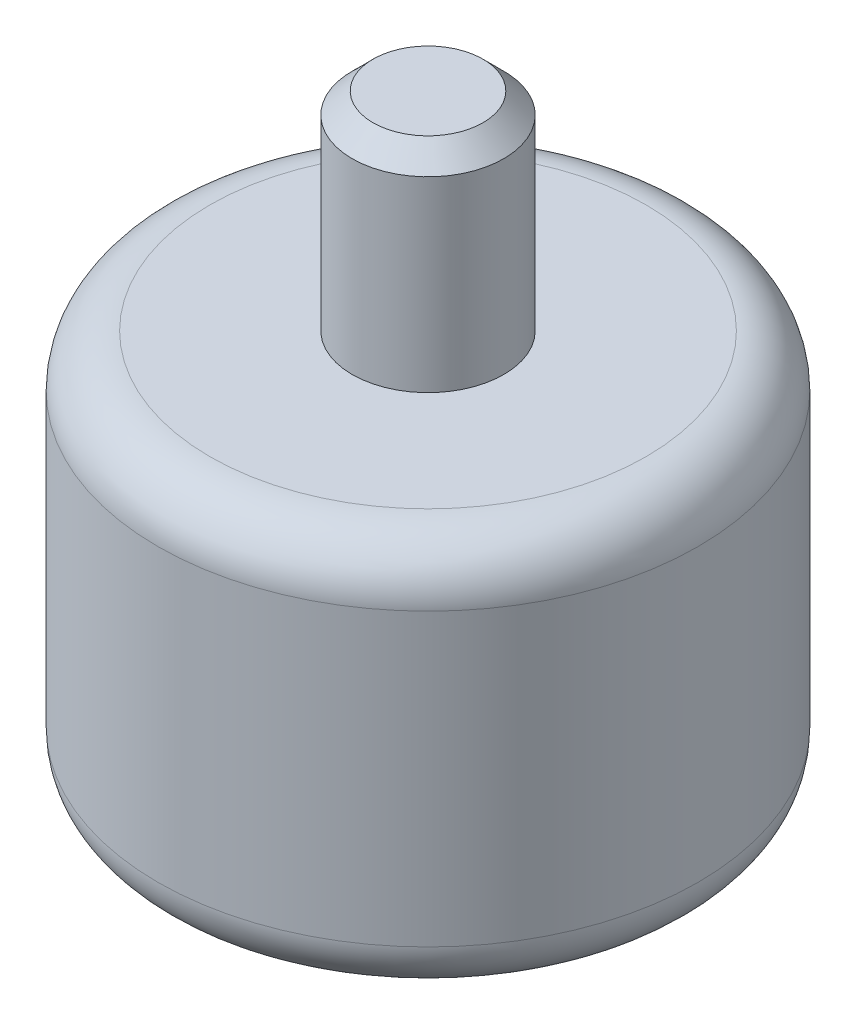
ISO-10303-21;
HEADER;
FILE_DESCRIPTION(('STEP AP214'),'2;1');
FILE_NAME('part.step','',(''),(''),'','','');
FILE_SCHEMA(('AUTOMOTIVE_DESIGN { 1 0 10303 214 1 1 1 1 }'));
ENDSEC;
DATA;
#1=APPLICATION_CONTEXT('core data for automotive mechanical design processes');
#2=APPLICATION_PROTOCOL_DEFINITION('international standard','automotive_design',2000,#1);
#3=PRODUCT_CONTEXT('',#1,'mechanical');
#4=PRODUCT('Part','Part','',(#3));
#5=PRODUCT_RELATED_PRODUCT_CATEGORY('part','',(#4));
#6=PRODUCT_DEFINITION_FORMATION('','',#4);
#7=PRODUCT_DEFINITION_CONTEXT('part definition',#1,'design');
#8=PRODUCT_DEFINITION('design','',#6,#7);
#9=PRODUCT_DEFINITION_SHAPE('','',#8);
#10=(LENGTH_UNIT() NAMED_UNIT(*) SI_UNIT(.MILLI.,.METRE.));
#11=(NAMED_UNIT(*) PLANE_ANGLE_UNIT() SI_UNIT($,.RADIAN.));
#12=(NAMED_UNIT(*) SI_UNIT($,.STERADIAN.) SOLID_ANGLE_UNIT());
#13=UNCERTAINTY_MEASURE_WITH_UNIT(LENGTH_MEASURE(1.E-05),#10,'distance_accuracy_value','');
#14=(GEOMETRIC_REPRESENTATION_CONTEXT(3) GLOBAL_UNCERTAINTY_ASSIGNED_CONTEXT((#13)) GLOBAL_UNIT_ASSIGNED_CONTEXT((#10,
#11,#12)) REPRESENTATION_CONTEXT('',''));
#15=CARTESIAN_POINT('',(0.,0.,0.));
#16=DIRECTION('',(0.,0.,1.));
#17=DIRECTION('',(1.,0.,0.));
#18=AXIS2_PLACEMENT_3D('',#15,#16,#17);
#19=CARTESIAN_POINT('',(0.,190.,0.));
#20=DIRECTION('',(0.,-1.,0.));
#21=DIRECTION('',(0.,0.,-1.));
#22=AXIS2_PLACEMENT_3D('',#19,#20,#21);
#23=CYLINDRICAL_SURFACE('',#22,130.);
#24=CARTESIAN_POINT('',(0.,165.,0.));
#25=DIRECTION('',(0.,1.,0.));
#26=DIRECTION('',(0.,0.,1.));
#27=AXIS2_PLACEMENT_3D('',#24,#25,#26);
#28=CIRCLE('',#27,130.);
#29=CARTESIAN_POINT('',(0.,165.,130.));
#30=VERTEX_POINT('',#29);
#31=EDGE_CURVE('E125',#30,#30,#28,.F.);
#32=ORIENTED_EDGE('',*,*,#31,.T.);
#33=EDGE_LOOP('',(#32));
#34=FACE_BOUND('',#33,.T.);
#35=CARTESIAN_POINT('',(0.,25.,0.));
#36=DIRECTION('',(0.,1.,0.));
#37=DIRECTION('',(0.,0.,1.));
#38=AXIS2_PLACEMENT_3D('',#35,#36,#37);
#39=CIRCLE('',#38,130.);
#40=CARTESIAN_POINT('',(0.,25.,130.));
#41=VERTEX_POINT('',#40);
#42=EDGE_CURVE('E121',#41,#41,#39,.T.);
#43=ORIENTED_EDGE('',*,*,#42,.T.);
#44=EDGE_LOOP('',(#43));
#45=FACE_BOUND('',#44,.T.);
#46=ADVANCED_FACE('F47',(#34,#45),#23,.T.);
#47=CARTESIAN_POINT('',(0.,190.,0.));
#48=DIRECTION('',(0.,1.,0.));
#49=DIRECTION('',(0.,0.,1.));
#50=AXIS2_PLACEMENT_3D('',#47,#48,#49);
#51=PLANE('',#50);
#52=CARTESIAN_POINT('',(0.,190.,0.));
#53=DIRECTION('',(0.,1.,0.));
#54=DIRECTION('',(0.,0.,1.));
#55=AXIS2_PLACEMENT_3D('',#52,#53,#54);
#56=CIRCLE('',#55,36.5);
#57=CARTESIAN_POINT('',(0.,190.,36.5));
#58=VERTEX_POINT('',#57);
#59=EDGE_CURVE('E90',#58,#58,#56,.T.);
#60=ORIENTED_EDGE('',*,*,#59,.F.);
#61=EDGE_LOOP('',(#60));
#62=FACE_BOUND('',#61,.T.);
#63=CARTESIAN_POINT('',(0.,190.,0.));
#64=DIRECTION('',(0.,1.,0.));
#65=DIRECTION('',(0.,0.,1.));
#66=AXIS2_PLACEMENT_3D('',#63,#64,#65);
#67=CIRCLE('',#66,105.);
#68=CARTESIAN_POINT('',(0.,190.,105.));
#69=VERTEX_POINT('',#68);
#70=EDGE_CURVE('E117',#69,#69,#67,.T.);
#71=ORIENTED_EDGE('',*,*,#70,.T.);
#72=EDGE_LOOP('',(#71));
#73=FACE_BOUND('',#72,.T.);
#74=ADVANCED_FACE('F151',(#62,#73),#51,.T.);
#75=CARTESIAN_POINT('',(0.,0.,0.));
#76=DIRECTION('',(0.,1.,0.));
#77=DIRECTION('',(0.,0.,1.));
#78=AXIS2_PLACEMENT_3D('',#75,#76,#77);
#79=PLANE('',#78);
#80=CARTESIAN_POINT('',(9.95072181570293E-13,0.,95.));
#81=DIRECTION('',(0.,-1.,0.));
#82=DIRECTION('',(0.,0.,-1.));
#83=AXIS2_PLACEMENT_3D('',#80,#81,#82);
#84=CIRCLE('',#83,3.39999999999999);
#85=CARTESIAN_POINT('',(9.95072181570293E-13,0.,91.6));
#86=VERTEX_POINT('',#85);
#87=EDGE_CURVE('E82',#86,#86,#84,.T.);
#88=ORIENTED_EDGE('',*,*,#87,.F.);
#89=EDGE_LOOP('',(#88));
#90=FACE_BOUND('',#89,.T.);
#91=CARTESIAN_POINT('',(95.,0.,0.));
#92=DIRECTION('',(0.,-1.,0.));
#93=DIRECTION('',(0.,0.,-1.));
#94=AXIS2_PLACEMENT_3D('',#91,#92,#93);
#95=CIRCLE('',#94,3.39999999999999);
#96=CARTESIAN_POINT('',(95.,0.,-3.39999999999999));
#97=VERTEX_POINT('',#96);
#98=EDGE_CURVE('E81',#97,#97,#95,.T.);
#99=ORIENTED_EDGE('',*,*,#98,.F.);
#100=EDGE_LOOP('',(#99));
#101=FACE_BOUND('',#100,.T.);
#102=CARTESIAN_POINT('',(-3.31690727190098E-13,0.,-95.));
#103=DIRECTION('',(0.,-1.,0.));
#104=DIRECTION('',(0.,0.,-1.));
#105=AXIS2_PLACEMENT_3D('',#102,#103,#104);
#106=CIRCLE('',#105,3.39999999999999);
#107=CARTESIAN_POINT('',(-3.31690727190098E-13,0.,-98.4));
#108=VERTEX_POINT('',#107);
#109=EDGE_CURVE('E97',#108,#108,#106,.T.);
#110=ORIENTED_EDGE('',*,*,#109,.F.);
#111=EDGE_LOOP('',(#110));
#112=FACE_BOUND('',#111,.T.);
#113=CARTESIAN_POINT('',(-95.,0.,6.63381454380195E-13));
#114=DIRECTION('',(0.,-1.,0.));
#115=DIRECTION('',(0.,0.,-1.));
#116=AXIS2_PLACEMENT_3D('',#113,#114,#115);
#117=CIRCLE('',#116,3.39999999999999);
#118=CARTESIAN_POINT('',(-95.,0.,-3.39999999999932));
#119=VERTEX_POINT('',#118);
#120=EDGE_CURVE('E105',#119,#119,#117,.T.);
#121=ORIENTED_EDGE('',*,*,#120,.F.);
#122=EDGE_LOOP('',(#121));
#123=FACE_BOUND('',#122,.T.);
#124=CARTESIAN_POINT('',(0.,0.,0.));
#125=DIRECTION('',(0.,1.,0.));
#126=DIRECTION('',(0.,0.,1.));
#127=AXIS2_PLACEMENT_3D('',#124,#125,#126);
#128=CIRCLE('',#127,36.5);
#129=CARTESIAN_POINT('',(0.,0.,36.5));
#130=VERTEX_POINT('',#129);
#131=EDGE_CURVE('E133',#130,#130,#128,.F.);
#132=ORIENTED_EDGE('',*,*,#131,.F.);
#133=EDGE_LOOP('',(#132));
#134=FACE_BOUND('',#133,.T.);
#135=CARTESIAN_POINT('',(0.,0.,0.));
#136=DIRECTION('',(0.,1.,0.));
#137=DIRECTION('',(0.,0.,1.));
#138=AXIS2_PLACEMENT_3D('',#135,#136,#137);
#139=CIRCLE('',#138,105.);
#140=CARTESIAN_POINT('',(0.,0.,105.));
#141=VERTEX_POINT('',#140);
#142=EDGE_CURVE('E129',#141,#141,#139,.F.);
#143=ORIENTED_EDGE('',*,*,#142,.T.);
#144=EDGE_LOOP('',(#143));
#145=FACE_BOUND('',#144,.T.);
#146=ADVANCED_FACE('F157',(#90,#101,#112,#123,#134,#145),#79,.F.);
#147=CARTESIAN_POINT('',(0.,165.,0.));
#148=DIRECTION('',(0.,1.,0.));
#149=DIRECTION('',(0.,0.,1.));
#150=AXIS2_PLACEMENT_3D('',#147,#148,#149);
#151=TOROIDAL_SURFACE('',#150,105.,25.);
#152=ORIENTED_EDGE('',*,*,#31,.F.);
#153=EDGE_LOOP('',(#152));
#154=FACE_BOUND('',#153,.T.);
#155=ORIENTED_EDGE('',*,*,#70,.F.);
#156=EDGE_LOOP('',(#155));
#157=FACE_BOUND('',#156,.T.);
#158=ADVANCED_FACE('F163',(#154,#157),#151,.T.);
#159=CARTESIAN_POINT('',(0.,25.,0.));
#160=DIRECTION('',(0.,1.,0.));
#161=DIRECTION('',(0.,0.,1.));
#162=AXIS2_PLACEMENT_3D('',#159,#160,#161);
#163=TOROIDAL_SURFACE('',#162,105.,25.);
#164=ORIENTED_EDGE('',*,*,#142,.F.);
#165=EDGE_LOOP('',(#164));
#166=FACE_BOUND('',#165,.T.);
#167=ORIENTED_EDGE('',*,*,#42,.F.);
#168=EDGE_LOOP('',(#167));
#169=FACE_BOUND('',#168,.T.);
#170=ADVANCED_FACE('F165',(#166,#169),#163,.T.);
#171=CARTESIAN_POINT('',(0.,-20.,0.));
#172=DIRECTION('',(0.,1.,0.));
#173=DIRECTION('',(0.,0.,1.));
#174=AXIS2_PLACEMENT_3D('',#171,#172,#173);
#175=CYLINDRICAL_SURFACE('',#174,36.5);
#176=CARTESIAN_POINT('',(0.,-20.,0.));
#177=DIRECTION('',(0.,-1.,0.));
#178=DIRECTION('',(0.,0.,-1.));
#179=AXIS2_PLACEMENT_3D('',#176,#177,#178);
#180=CIRCLE('',#179,36.5);
#181=CARTESIAN_POINT('',(0.,-20.,-36.5));
#182=VERTEX_POINT('',#181);
#183=EDGE_CURVE('E113',#182,#182,#180,.T.);
#184=ORIENTED_EDGE('',*,*,#183,.F.);
#185=EDGE_LOOP('',(#184));
#186=FACE_BOUND('',#185,.T.);
#187=ORIENTED_EDGE('',*,*,#131,.T.);
#188=EDGE_LOOP('',(#187));
#189=FACE_BOUND('',#188,.T.);
#190=ADVANCED_FACE('F168',(#186,#189),#175,.T.);
#191=CARTESIAN_POINT('',(0.,-20.,0.));
#192=DIRECTION('',(0.,-1.,0.));
#193=DIRECTION('',(0.,0.,-1.));
#194=AXIS2_PLACEMENT_3D('',#191,#192,#193);
#195=PLANE('',#194);
#196=ORIENTED_EDGE('',*,*,#183,.T.);
#197=EDGE_LOOP('',(#196));
#198=FACE_BOUND('',#197,.T.);
#199=ADVANCED_FACE('F173',(#198),#195,.T.);
#200=CARTESIAN_POINT('',(-95.,17.7070738953063,6.63381454380195E-13));
#201=DIRECTION('',(0.,-1.,0.));
#202=DIRECTION('',(0.,0.,-1.));
#203=AXIS2_PLACEMENT_3D('',#200,#201,#202);
#204=CONICAL_SURFACE('',#203,3.4,1.02974425867666);
#205=CARTESIAN_POINT('',(-95.,19.75,6.63381454380195E-13));
#206=VERTEX_POINT('',#205);
#207=VERTEX_LOOP('',#206);
#208=FACE_BOUND('',#207,.T.);
#209=CARTESIAN_POINT('',(-95.,17.7070738953063,6.63381454380195E-13));
#210=DIRECTION('',(0.,-1.,0.));
#211=DIRECTION('',(0.,0.,-1.));
#212=AXIS2_PLACEMENT_3D('',#209,#210,#211);
#213=CIRCLE('',#212,3.4);
#214=CARTESIAN_POINT('',(-95.,17.7070738953063,-3.39999999999934));
#215=VERTEX_POINT('',#214);
#216=EDGE_CURVE('E109',#215,#215,#213,.T.);
#217=ORIENTED_EDGE('',*,*,#216,.T.);
#218=EDGE_LOOP('',(#217));
#219=FACE_BOUND('',#218,.T.);
#220=ADVANCED_FACE('F198',(#208,#219),#204,.F.);
#221=CARTESIAN_POINT('',(-95.,0.,6.63381454380195E-13));
#222=DIRECTION('',(0.,-1.,0.));
#223=DIRECTION('',(0.,0.,-1.));
#224=AXIS2_PLACEMENT_3D('',#221,#222,#223);
#225=CYLINDRICAL_SURFACE('',#224,3.39999999999999);
#226=ORIENTED_EDGE('',*,*,#216,.F.);
#227=EDGE_LOOP('',(#226));
#228=FACE_BOUND('',#227,.T.);
#229=ORIENTED_EDGE('',*,*,#120,.T.);
#230=EDGE_LOOP('',(#229));
#231=FACE_BOUND('',#230,.T.);
#232=ADVANCED_FACE('F195',(#228,#231),#225,.F.);
#233=CARTESIAN_POINT('',(-3.31690727190098E-13,17.7070738953063,-95.));
#234=DIRECTION('',(0.,-1.,0.));
#235=DIRECTION('',(0.,0.,-1.));
#236=AXIS2_PLACEMENT_3D('',#233,#234,#235);
#237=CONICAL_SURFACE('',#236,3.4,1.02974425867665);
#238=CARTESIAN_POINT('',(-3.36461216749034E-13,19.75,-95.));
#239=VERTEX_POINT('',#238);
#240=VERTEX_LOOP('',#239);
#241=FACE_BOUND('',#240,.T.);
#242=CARTESIAN_POINT('',(-3.31690727190098E-13,17.7070738953063,-95.));
#243=DIRECTION('',(0.,-1.,0.));
#244=DIRECTION('',(0.,0.,-1.));
#245=AXIS2_PLACEMENT_3D('',#242,#243,#244);
#246=CIRCLE('',#245,3.4);
#247=CARTESIAN_POINT('',(-3.31690727190098E-13,17.7070738953063,-98.4));
#248=VERTEX_POINT('',#247);
#249=EDGE_CURVE('E101',#248,#248,#246,.T.);
#250=ORIENTED_EDGE('',*,*,#249,.T.);
#251=EDGE_LOOP('',(#250));
#252=FACE_BOUND('',#251,.T.);
#253=ADVANCED_FACE('F197',(#241,#252),#237,.F.);
#254=CARTESIAN_POINT('',(-3.31690727190098E-13,0.,-95.));
#255=DIRECTION('',(0.,-1.,0.));
#256=DIRECTION('',(0.,0.,-1.));
#257=AXIS2_PLACEMENT_3D('',#254,#255,#256);
#258=CYLINDRICAL_SURFACE('',#257,3.39999999999999);
#259=ORIENTED_EDGE('',*,*,#249,.F.);
#260=EDGE_LOOP('',(#259));
#261=FACE_BOUND('',#260,.T.);
#262=ORIENTED_EDGE('',*,*,#109,.T.);
#263=EDGE_LOOP('',(#262));
#264=FACE_BOUND('',#263,.T.);
#265=ADVANCED_FACE('F205',(#261,#264),#258,.F.);
#266=CARTESIAN_POINT('',(95.,17.7070738953063,0.));
#267=DIRECTION('',(0.,-1.,0.));
#268=DIRECTION('',(0.,0.,-1.));
#269=AXIS2_PLACEMENT_3D('',#266,#267,#268);
#270=CONICAL_SURFACE('',#269,3.4,1.02974425867666);
#271=CARTESIAN_POINT('',(95.,19.75,0.));
#272=VERTEX_POINT('',#271);
#273=VERTEX_LOOP('',#272);
#274=FACE_BOUND('',#273,.T.);
#275=CARTESIAN_POINT('',(95.,17.7070738953063,0.));
#276=DIRECTION('',(0.,-1.,0.));
#277=DIRECTION('',(0.,0.,-1.));
#278=AXIS2_PLACEMENT_3D('',#275,#276,#277);
#279=CIRCLE('',#278,3.4);
#280=CARTESIAN_POINT('',(95.,17.7070738953063,-3.4));
#281=VERTEX_POINT('',#280);
#282=EDGE_CURVE('E87',#281,#281,#279,.T.);
#283=ORIENTED_EDGE('',*,*,#282,.T.);
#284=EDGE_LOOP('',(#283));
#285=FACE_BOUND('',#284,.T.);
#286=ADVANCED_FACE('F250',(#274,#285),#270,.F.);
#287=CARTESIAN_POINT('',(95.,0.,0.));
#288=DIRECTION('',(0.,-1.,0.));
#289=DIRECTION('',(0.,0.,-1.));
#290=AXIS2_PLACEMENT_3D('',#287,#288,#289);
#291=CYLINDRICAL_SURFACE('',#290,3.39999999999999);
#292=ORIENTED_EDGE('',*,*,#282,.F.);
#293=EDGE_LOOP('',(#292));
#294=FACE_BOUND('',#293,.T.);
#295=ORIENTED_EDGE('',*,*,#98,.T.);
#296=EDGE_LOOP('',(#295));
#297=FACE_BOUND('',#296,.T.);
#298=ADVANCED_FACE('F74',(#294,#297),#291,.F.);
#299=CARTESIAN_POINT('',(9.95072181570293E-13,17.7070738953063,95.));
#300=DIRECTION('',(0.,-1.,0.));
#301=DIRECTION('',(0.,0.,-1.));
#302=AXIS2_PLACEMENT_3D('',#299,#300,#301);
#303=CONICAL_SURFACE('',#302,3.4,1.02974425867665);
#304=CARTESIAN_POINT('',(9.90301692011357E-13,19.75,95.));
#305=VERTEX_POINT('',#304);
#306=VERTEX_LOOP('',#305);
#307=FACE_BOUND('',#306,.T.);
#308=CARTESIAN_POINT('',(9.95072181570293E-13,17.7070738953063,95.));
#309=DIRECTION('',(0.,-1.,0.));
#310=DIRECTION('',(0.,0.,-1.));
#311=AXIS2_PLACEMENT_3D('',#308,#309,#310);
#312=CIRCLE('',#311,3.4);
#313=CARTESIAN_POINT('',(9.95072181570293E-13,17.7070738953063,91.6));
#314=VERTEX_POINT('',#313);
#315=EDGE_CURVE('E78',#314,#314,#312,.T.);
#316=ORIENTED_EDGE('',*,*,#315,.T.);
#317=EDGE_LOOP('',(#316));
#318=FACE_BOUND('',#317,.T.);
#319=ADVANCED_FACE('F70',(#307,#318),#303,.F.);
#320=CARTESIAN_POINT('',(9.95072181570293E-13,0.,95.));
#321=DIRECTION('',(0.,-1.,0.));
#322=DIRECTION('',(0.,0.,-1.));
#323=AXIS2_PLACEMENT_3D('',#320,#321,#322);
#324=CYLINDRICAL_SURFACE('',#323,3.39999999999999);
#325=ORIENTED_EDGE('',*,*,#315,.F.);
#326=EDGE_LOOP('',(#325));
#327=FACE_BOUND('',#326,.T.);
#328=ORIENTED_EDGE('',*,*,#87,.T.);
#329=EDGE_LOOP('',(#328));
#330=FACE_BOUND('',#329,.T.);
#331=ADVANCED_FACE('F73',(#327,#330),#324,.F.);
#332=CARTESIAN_POINT('',(0.,290.,0.));
#333=DIRECTION('',(0.,-1.,0.));
#334=DIRECTION('',(0.,0.,-1.));
#335=AXIS2_PLACEMENT_3D('',#332,#333,#334);
#336=CYLINDRICAL_SURFACE('',#335,36.5);
#337=CARTESIAN_POINT('',(0.,280.,0.));
#338=DIRECTION('',(0.,1.,0.));
#339=DIRECTION('',(0.,0.,1.));
#340=AXIS2_PLACEMENT_3D('',#337,#338,#339);
#341=CIRCLE('',#340,36.5);
#342=CARTESIAN_POINT('',(0.,280.,36.5));
#343=VERTEX_POINT('',#342);
#344=EDGE_CURVE('E11',#343,#343,#341,.F.);
#345=ORIENTED_EDGE('',*,*,#344,.T.);
#346=EDGE_LOOP('',(#345));
#347=FACE_BOUND('',#346,.T.);
#348=ORIENTED_EDGE('',*,*,#59,.T.);
#349=EDGE_LOOP('',(#348));
#350=FACE_BOUND('',#349,.T.);
#351=ADVANCED_FACE('F147',(#347,#350),#336,.T.);
#352=CARTESIAN_POINT('',(0.,290.,0.));
#353=DIRECTION('',(0.,1.,0.));
#354=DIRECTION('',(0.,0.,1.));
#355=AXIS2_PLACEMENT_3D('',#352,#353,#354);
#356=PLANE('',#355);
#357=CARTESIAN_POINT('',(0.,290.,0.));
#358=DIRECTION('',(0.,1.,0.));
#359=DIRECTION('',(0.,0.,1.));
#360=AXIS2_PLACEMENT_3D('',#357,#358,#359);
#361=CIRCLE('',#360,26.5000000000001);
#362=CARTESIAN_POINT('',(0.,290.,26.5000000000001));
#363=VERTEX_POINT('',#362);
#364=EDGE_CURVE('E57',#363,#363,#361,.T.);
#365=ORIENTED_EDGE('',*,*,#364,.T.);
#366=EDGE_LOOP('',(#365));
#367=FACE_BOUND('',#366,.T.);
#368=ADVANCED_FACE('F140',(#367),#356,.T.);
#369=CARTESIAN_POINT('',(0.,290.,0.));
#370=DIRECTION('',(0.,-1.,0.));
#371=DIRECTION('',(0.,0.,-1.));
#372=AXIS2_PLACEMENT_3D('',#369,#370,#371);
#373=CONICAL_SURFACE('',#372,26.5000000000001,0.785398163397444);
#374=ORIENTED_EDGE('',*,*,#344,.F.);
#375=EDGE_LOOP('',(#374));
#376=FACE_BOUND('',#375,.T.);
#377=ORIENTED_EDGE('',*,*,#364,.F.);
#378=EDGE_LOOP('',(#377));
#379=FACE_BOUND('',#378,.T.);
#380=ADVANCED_FACE('F50',(#376,#379),#373,.T.);
#381=CLOSED_SHELL('',(#46,#74,#146,#158,#170,#190,#199,#220,#232,#253,#265,#286,#298,#319,#331,
#351,#368,#380));
#382=MANIFOLD_SOLID_BREP('B2',#381);
#383=ADVANCED_BREP_SHAPE_REPRESENTATION('',(#18,#382),#14);
#384=SHAPE_DEFINITION_REPRESENTATION(#9,#383);
ENDSEC;
END-ISO-10303-21;
